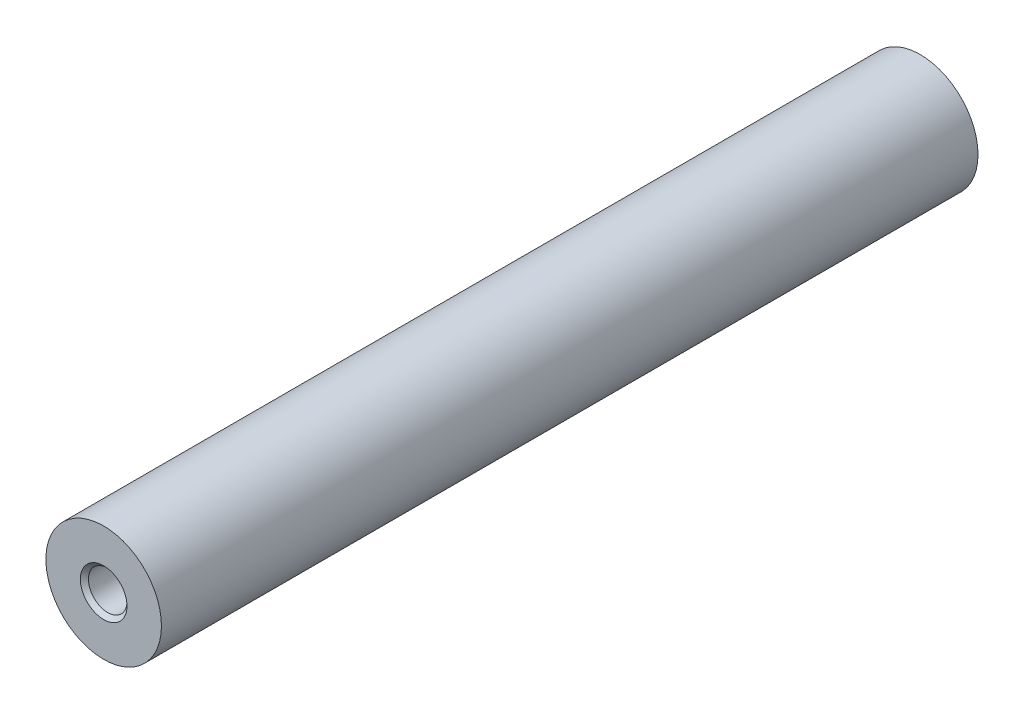
ISO-10303-21;
HEADER;
FILE_DESCRIPTION(('STEP AP214'),'2;1');
FILE_NAME('part.step','',(''),(''),'','','');
FILE_SCHEMA(('AUTOMOTIVE_DESIGN { 1 0 10303 214 1 1 1 1 }'));
ENDSEC;
DATA;
#1=APPLICATION_CONTEXT('core data for automotive mechanical design processes');
#2=APPLICATION_PROTOCOL_DEFINITION('international standard','automotive_design',2000,#1);
#3=PRODUCT_CONTEXT('',#1,'mechanical');
#4=PRODUCT('Part','Part','',(#3));
#5=PRODUCT_RELATED_PRODUCT_CATEGORY('part','',(#4));
#6=PRODUCT_DEFINITION_FORMATION('','',#4);
#7=PRODUCT_DEFINITION_CONTEXT('part definition',#1,'design');
#8=PRODUCT_DEFINITION('design','',#6,#7);
#9=PRODUCT_DEFINITION_SHAPE('','',#8);
#10=(LENGTH_UNIT() NAMED_UNIT(*) SI_UNIT(.MILLI.,.METRE.));
#11=(NAMED_UNIT(*) PLANE_ANGLE_UNIT() SI_UNIT($,.RADIAN.));
#12=(NAMED_UNIT(*) SI_UNIT($,.STERADIAN.) SOLID_ANGLE_UNIT());
#13=UNCERTAINTY_MEASURE_WITH_UNIT(LENGTH_MEASURE(1.E-05),#10,'distance_accuracy_value','');
#14=(GEOMETRIC_REPRESENTATION_CONTEXT(3) GLOBAL_UNCERTAINTY_ASSIGNED_CONTEXT((#13)) GLOBAL_UNIT_ASSIGNED_CONTEXT((#10,
#11,#12)) REPRESENTATION_CONTEXT('',''));
#15=CARTESIAN_POINT('',(0.,0.,0.));
#16=DIRECTION('',(0.,0.,1.));
#17=DIRECTION('',(1.,0.,0.));
#18=AXIS2_PLACEMENT_3D('',#15,#16,#17);
#19=CARTESIAN_POINT('',(0.,0.,53.));
#20=DIRECTION('',(0.,0.,-1.));
#21=DIRECTION('',(-1.,0.,0.));
#22=AXIS2_PLACEMENT_3D('',#19,#20,#21);
#23=CYLINDRICAL_SURFACE('',#22,7.5);
#24=CARTESIAN_POINT('',(0.,0.,53.));
#25=DIRECTION('',(0.,0.,1.));
#26=DIRECTION('',(1.,0.,0.));
#27=AXIS2_PLACEMENT_3D('',#24,#25,#26);
#28=CIRCLE('',#27,7.5);
#29=CARTESIAN_POINT('',(7.5,0.,53.));
#30=VERTEX_POINT('',#29);
#31=EDGE_CURVE('E11',#30,#30,#28,.T.);
#32=ORIENTED_EDGE('',*,*,#31,.F.);
#33=EDGE_LOOP('',(#32));
#34=FACE_BOUND('',#33,.T.);
#35=CARTESIAN_POINT('',(0.,0.,-53.));
#36=DIRECTION('',(0.,0.,1.));
#37=DIRECTION('',(1.,0.,0.));
#38=AXIS2_PLACEMENT_3D('',#35,#36,#37);
#39=CIRCLE('',#38,7.5);
#40=CARTESIAN_POINT('',(7.5,0.,-53.));
#41=VERTEX_POINT('',#40);
#42=EDGE_CURVE('E42',#41,#41,#39,.T.);
#43=ORIENTED_EDGE('',*,*,#42,.T.);
#44=EDGE_LOOP('',(#43));
#45=FACE_BOUND('',#44,.T.);
#46=ADVANCED_FACE('F39',(#34,#45),#23,.T.);
#47=CARTESIAN_POINT('',(0.,0.,53.));
#48=DIRECTION('',(0.,0.,1.));
#49=DIRECTION('',(1.,0.,0.));
#50=AXIS2_PLACEMENT_3D('',#47,#48,#49);
#51=PLANE('',#50);
#52=CARTESIAN_POINT('',(0.,0.,53.));
#53=DIRECTION('',(0.,0.,1.));
#54=DIRECTION('',(1.,0.,0.));
#55=AXIS2_PLACEMENT_3D('',#52,#53,#54);
#56=CIRCLE('',#55,3.025);
#57=CARTESIAN_POINT('',(3.025,0.,53.));
#58=VERTEX_POINT('',#57);
#59=EDGE_CURVE('E62',#58,#58,#56,.T.);
#60=ORIENTED_EDGE('',*,*,#59,.F.);
#61=EDGE_LOOP('',(#60));
#62=FACE_BOUND('',#61,.T.);
#63=ORIENTED_EDGE('',*,*,#31,.T.);
#64=EDGE_LOOP('',(#63));
#65=FACE_BOUND('',#64,.T.);
#66=ADVANCED_FACE('F86',(#62,#65),#51,.T.);
#67=CARTESIAN_POINT('',(0.,0.,-53.));
#68=DIRECTION('',(0.,0.,1.));
#69=DIRECTION('',(1.,0.,0.));
#70=AXIS2_PLACEMENT_3D('',#67,#68,#69);
#71=PLANE('',#70);
#72=CARTESIAN_POINT('',(0.,0.,-53.));
#73=DIRECTION('',(0.,0.,-1.));
#74=DIRECTION('',(-1.,0.,0.));
#75=AXIS2_PLACEMENT_3D('',#72,#73,#74);
#76=CIRCLE('',#75,3.025);
#77=CARTESIAN_POINT('',(-3.025,0.,-53.));
#78=VERTEX_POINT('',#77);
#79=EDGE_CURVE('E69',#78,#78,#76,.T.);
#80=ORIENTED_EDGE('',*,*,#79,.F.);
#81=EDGE_LOOP('',(#80));
#82=FACE_BOUND('',#81,.T.);
#83=ORIENTED_EDGE('',*,*,#42,.F.);
#84=EDGE_LOOP('',(#83));
#85=FACE_BOUND('',#84,.T.);
#86=ADVANCED_FACE('F83',(#82,#85),#71,.F.);
#87=CARTESIAN_POINT('',(0.,0.,38.));
#88=DIRECTION('',(0.,0.,1.));
#89=DIRECTION('',(1.,0.,0.));
#90=AXIS2_PLACEMENT_3D('',#87,#88,#89);
#91=CONICAL_SURFACE('',#90,2.5,1.02974425867665);
#92=CARTESIAN_POINT('',(0.,0.,36.4978484524311));
#93=VERTEX_POINT('',#92);
#94=VERTEX_LOOP('',#93);
#95=FACE_BOUND('',#94,.T.);
#96=CARTESIAN_POINT('',(0.,0.,38.));
#97=DIRECTION('',(0.,0.,1.));
#98=DIRECTION('',(1.,0.,0.));
#99=AXIS2_PLACEMENT_3D('',#96,#97,#98);
#100=CIRCLE('',#99,2.5);
#101=CARTESIAN_POINT('',(2.5,0.,38.));
#102=VERTEX_POINT('',#101);
#103=EDGE_CURVE('E75',#102,#102,#100,.T.);
#104=ORIENTED_EDGE('',*,*,#103,.T.);
#105=EDGE_LOOP('',(#104));
#106=FACE_BOUND('',#105,.T.);
#107=ADVANCED_FACE('F85',(#95,#106),#91,.F.);
#108=CARTESIAN_POINT('',(0.,0.,53.));
#109=DIRECTION('',(0.,0.,1.));
#110=DIRECTION('',(1.,0.,0.));
#111=AXIS2_PLACEMENT_3D('',#108,#109,#110);
#112=CYLINDRICAL_SURFACE('',#111,2.5);
#113=ORIENTED_EDGE('',*,*,#103,.F.);
#114=EDGE_LOOP('',(#113));
#115=FACE_BOUND('',#114,.T.);
#116=CARTESIAN_POINT('',(0.,0.,52.475));
#117=DIRECTION('',(0.,0.,1.));
#118=DIRECTION('',(1.,0.,0.));
#119=AXIS2_PLACEMENT_3D('',#116,#117,#118);
#120=CIRCLE('',#119,2.5);
#121=CARTESIAN_POINT('',(2.5,0.,52.475));
#122=VERTEX_POINT('',#121);
#123=EDGE_CURVE('E66',#122,#122,#120,.T.);
#124=ORIENTED_EDGE('',*,*,#123,.T.);
#125=EDGE_LOOP('',(#124));
#126=FACE_BOUND('',#125,.T.);
#127=ADVANCED_FACE('F92',(#115,#126),#112,.F.);
#128=CARTESIAN_POINT('',(0.,0.,53.));
#129=DIRECTION('',(0.,0.,1.));
#130=DIRECTION('',(1.,0.,0.));
#131=AXIS2_PLACEMENT_3D('',#128,#129,#130);
#132=CONICAL_SURFACE('',#131,3.025,0.785398163397452);
#133=ORIENTED_EDGE('',*,*,#123,.F.);
#134=EDGE_LOOP('',(#133));
#135=FACE_BOUND('',#134,.T.);
#136=ORIENTED_EDGE('',*,*,#59,.T.);
#137=EDGE_LOOP('',(#136));
#138=FACE_BOUND('',#137,.T.);
#139=ADVANCED_FACE('F56',(#135,#138),#132,.F.);
#140=CARTESIAN_POINT('',(0.,0.,-38.));
#141=DIRECTION('',(0.,0.,-1.));
#142=DIRECTION('',(-1.,0.,0.));
#143=AXIS2_PLACEMENT_3D('',#140,#141,#142);
#144=CONICAL_SURFACE('',#143,2.5,1.02974425867665);
#145=CARTESIAN_POINT('',(0.,0.,-36.4978484524311));
#146=VERTEX_POINT('',#145);
#147=VERTEX_LOOP('',#146);
#148=FACE_BOUND('',#147,.T.);
#149=CARTESIAN_POINT('',(0.,0.,-38.));
#150=DIRECTION('',(0.,0.,-1.));
#151=DIRECTION('',(-1.,0.,0.));
#152=AXIS2_PLACEMENT_3D('',#149,#150,#151);
#153=CIRCLE('',#152,2.5);
#154=CARTESIAN_POINT('',(-2.5,0.,-38.));
#155=VERTEX_POINT('',#154);
#156=EDGE_CURVE('E60',#155,#155,#153,.T.);
#157=ORIENTED_EDGE('',*,*,#156,.T.);
#158=EDGE_LOOP('',(#157));
#159=FACE_BOUND('',#158,.T.);
#160=ADVANCED_FACE('F52',(#148,#159),#144,.F.);
#161=CARTESIAN_POINT('',(0.,0.,-53.));
#162=DIRECTION('',(0.,0.,-1.));
#163=DIRECTION('',(-1.,0.,0.));
#164=AXIS2_PLACEMENT_3D('',#161,#162,#163);
#165=CYLINDRICAL_SURFACE('',#164,2.5);
#166=ORIENTED_EDGE('',*,*,#156,.F.);
#167=EDGE_LOOP('',(#166));
#168=FACE_BOUND('',#167,.T.);
#169=CARTESIAN_POINT('',(0.,0.,-52.475));
#170=DIRECTION('',(0.,0.,-1.));
#171=DIRECTION('',(-1.,0.,0.));
#172=AXIS2_PLACEMENT_3D('',#169,#170,#171);
#173=CIRCLE('',#172,2.5);
#174=CARTESIAN_POINT('',(-2.5,0.,-52.475));
#175=VERTEX_POINT('',#174);
#176=EDGE_CURVE('E63',#175,#175,#173,.T.);
#177=ORIENTED_EDGE('',*,*,#176,.T.);
#178=EDGE_LOOP('',(#177));
#179=FACE_BOUND('',#178,.T.);
#180=ADVANCED_FACE('F55',(#168,#179),#165,.F.);
#181=CARTESIAN_POINT('',(0.,0.,-53.));
#182=DIRECTION('',(0.,0.,-1.));
#183=DIRECTION('',(-1.,0.,0.));
#184=AXIS2_PLACEMENT_3D('',#181,#182,#183);
#185=CONICAL_SURFACE('',#184,3.025,0.785398163397452);
#186=ORIENTED_EDGE('',*,*,#176,.F.);
#187=EDGE_LOOP('',(#186));
#188=FACE_BOUND('',#187,.T.);
#189=ORIENTED_EDGE('',*,*,#79,.T.);
#190=EDGE_LOOP('',(#189));
#191=FACE_BOUND('',#190,.T.);
#192=ADVANCED_FACE('F131',(#188,#191),#185,.F.);
#193=CLOSED_SHELL('',(#46,#66,#86,#107,#127,#139,#160,#180,#192));
#194=MANIFOLD_SOLID_BREP('B2',#193);
#195=ADVANCED_BREP_SHAPE_REPRESENTATION('',(#18,#194),#14);
#196=SHAPE_DEFINITION_REPRESENTATION(#9,#195);
ENDSEC;
END-ISO-10303-21;
